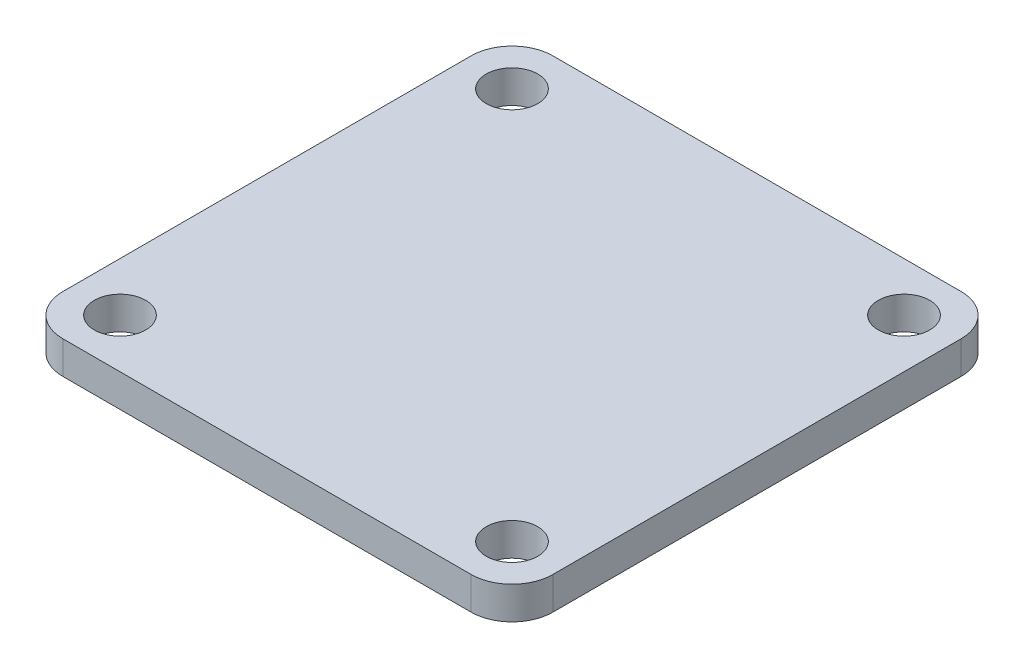
ISO-10303-21;
HEADER;
FILE_DESCRIPTION(('STEP AP214'),'2;1');
FILE_NAME('part.step','',(''),(''),'','','');
FILE_SCHEMA(('AUTOMOTIVE_DESIGN { 1 0 10303 214 1 1 1 1 }'));
ENDSEC;
DATA;
#1=APPLICATION_CONTEXT('core data for automotive mechanical design processes');
#2=APPLICATION_PROTOCOL_DEFINITION('international standard','automotive_design',2000,#1);
#3=PRODUCT_CONTEXT('',#1,'mechanical');
#4=PRODUCT('Part','Part','',(#3));
#5=PRODUCT_RELATED_PRODUCT_CATEGORY('part','',(#4));
#6=PRODUCT_DEFINITION_FORMATION('','',#4);
#7=PRODUCT_DEFINITION_CONTEXT('part definition',#1,'design');
#8=PRODUCT_DEFINITION('design','',#6,#7);
#9=PRODUCT_DEFINITION_SHAPE('','',#8);
#10=(LENGTH_UNIT() NAMED_UNIT(*) SI_UNIT(.MILLI.,.METRE.));
#11=(NAMED_UNIT(*) PLANE_ANGLE_UNIT() SI_UNIT($,.RADIAN.));
#12=(NAMED_UNIT(*) SI_UNIT($,.STERADIAN.) SOLID_ANGLE_UNIT());
#13=UNCERTAINTY_MEASURE_WITH_UNIT(LENGTH_MEASURE(1.E-05),#10,'distance_accuracy_value','');
#14=(GEOMETRIC_REPRESENTATION_CONTEXT(3) GLOBAL_UNCERTAINTY_ASSIGNED_CONTEXT((#13)) GLOBAL_UNIT_ASSIGNED_CONTEXT((#10,
#11,#12)) REPRESENTATION_CONTEXT('',''));
#15=CARTESIAN_POINT('',(0.,0.,0.));
#16=DIRECTION('',(0.,0.,1.));
#17=DIRECTION('',(1.,0.,0.));
#18=AXIS2_PLACEMENT_3D('',#15,#16,#17);
#19=CARTESIAN_POINT('',(0.,4.,0.));
#20=DIRECTION('',(0.,-1.,0.));
#21=DIRECTION('',(0.,0.,-1.));
#22=AXIS2_PLACEMENT_3D('',#19,#20,#21);
#23=PLANE('',#22);
#24=DIRECTION('',(0.,0.,1.));
#25=VECTOR('',#24,1.);
#26=CARTESIAN_POINT('',(-30.,4.,30.));
#27=LINE('',#26,#25);
#28=CARTESIAN_POINT('',(-30.,4.,-25.));
#29=VERTEX_POINT('',#28);
#30=CARTESIAN_POINT('',(-30.,4.,25.));
#31=VERTEX_POINT('',#30);
#32=EDGE_CURVE('E172',#29,#31,#27,.T.);
#33=ORIENTED_EDGE('',*,*,#32,.T.);
#34=CARTESIAN_POINT('',(-25.,4.,25.));
#35=DIRECTION('',(0.,-1.,0.));
#36=DIRECTION('',(0.,0.,-1.));
#37=AXIS2_PLACEMENT_3D('',#34,#35,#36);
#38=CIRCLE('',#37,5.);
#39=CARTESIAN_POINT('',(-25.,4.,30.));
#40=VERTEX_POINT('',#39);
#41=EDGE_CURVE('E149',#31,#40,#38,.F.);
#42=ORIENTED_EDGE('',*,*,#41,.T.);
#43=DIRECTION('',(1.,0.,0.));
#44=VECTOR('',#43,1.);
#45=CARTESIAN_POINT('',(-30.,4.,30.));
#46=LINE('',#45,#44);
#47=CARTESIAN_POINT('',(25.,4.,30.));
#48=VERTEX_POINT('',#47);
#49=EDGE_CURVE('E120',#40,#48,#46,.T.);
#50=ORIENTED_EDGE('',*,*,#49,.T.);
#51=CARTESIAN_POINT('',(25.,4.,25.));
#52=DIRECTION('',(0.,-1.,0.));
#53=DIRECTION('',(0.,0.,-1.));
#54=AXIS2_PLACEMENT_3D('',#51,#52,#53);
#55=CIRCLE('',#54,5.);
#56=CARTESIAN_POINT('',(30.,4.,25.));
#57=VERTEX_POINT('',#56);
#58=EDGE_CURVE('E147',#48,#57,#55,.F.);
#59=ORIENTED_EDGE('',*,*,#58,.T.);
#60=DIRECTION('',(0.,0.,-1.));
#61=VECTOR('',#60,1.);
#62=CARTESIAN_POINT('',(30.,4.,30.));
#63=LINE('',#62,#61);
#64=CARTESIAN_POINT('',(30.,4.,-25.));
#65=VERTEX_POINT('',#64);
#66=EDGE_CURVE('E127',#57,#65,#63,.T.);
#67=ORIENTED_EDGE('',*,*,#66,.T.);
#68=CARTESIAN_POINT('',(25.,4.,-25.));
#69=DIRECTION('',(0.,-1.,0.));
#70=DIRECTION('',(0.,0.,-1.));
#71=AXIS2_PLACEMENT_3D('',#68,#69,#70);
#72=CIRCLE('',#71,5.);
#73=CARTESIAN_POINT('',(25.,4.,-30.));
#74=VERTEX_POINT('',#73);
#75=EDGE_CURVE('E55',#65,#74,#72,.F.);
#76=ORIENTED_EDGE('',*,*,#75,.T.);
#77=DIRECTION('',(-1.,0.,0.));
#78=VECTOR('',#77,1.);
#79=CARTESIAN_POINT('',(-30.,4.,-30.));
#80=LINE('',#79,#78);
#81=CARTESIAN_POINT('',(-25.,4.,-30.));
#82=VERTEX_POINT('',#81);
#83=EDGE_CURVE('E130',#74,#82,#80,.T.);
#84=ORIENTED_EDGE('',*,*,#83,.T.);
#85=CARTESIAN_POINT('',(-25.,4.,-25.));
#86=DIRECTION('',(0.,-1.,0.));
#87=DIRECTION('',(0.,0.,-1.));
#88=AXIS2_PLACEMENT_3D('',#85,#86,#87);
#89=CIRCLE('',#88,5.);
#90=EDGE_CURVE('E144',#82,#29,#89,.F.);
#91=ORIENTED_EDGE('',*,*,#90,.T.);
#92=EDGE_LOOP('',(#33,#42,#50,#59,#67,#76,#84,#91));
#93=FACE_BOUND('',#92,.T.);
#94=CARTESIAN_POINT('',(-24.,4.,-24.));
#95=DIRECTION('',(0.,1.,0.));
#96=DIRECTION('',(0.,0.,1.));
#97=AXIS2_PLACEMENT_3D('',#94,#95,#96);
#98=CIRCLE('',#97,3.15);
#99=CARTESIAN_POINT('',(-24.,4.,-20.85));
#100=VERTEX_POINT('',#99);
#101=EDGE_CURVE('E165',#100,#100,#98,.T.);
#102=ORIENTED_EDGE('',*,*,#101,.F.);
#103=EDGE_LOOP('',(#102));
#104=FACE_BOUND('',#103,.T.);
#105=CARTESIAN_POINT('',(24.,4.,-24.));
#106=DIRECTION('',(0.,1.,0.));
#107=DIRECTION('',(0.,0.,1.));
#108=AXIS2_PLACEMENT_3D('',#105,#106,#107);
#109=CIRCLE('',#108,3.15);
#110=CARTESIAN_POINT('',(24.,4.,-20.85));
#111=VERTEX_POINT('',#110);
#112=EDGE_CURVE('E177',#111,#111,#109,.T.);
#113=ORIENTED_EDGE('',*,*,#112,.F.);
#114=EDGE_LOOP('',(#113));
#115=FACE_BOUND('',#114,.T.);
#116=CARTESIAN_POINT('',(-24.,4.,24.));
#117=DIRECTION('',(0.,1.,0.));
#118=DIRECTION('',(0.,0.,1.));
#119=AXIS2_PLACEMENT_3D('',#116,#117,#118);
#120=CIRCLE('',#119,3.15);
#121=CARTESIAN_POINT('',(-24.,4.,27.15));
#122=VERTEX_POINT('',#121);
#123=EDGE_CURVE('E182',#122,#122,#120,.T.);
#124=ORIENTED_EDGE('',*,*,#123,.F.);
#125=EDGE_LOOP('',(#124));
#126=FACE_BOUND('',#125,.T.);
#127=CARTESIAN_POINT('',(24.,4.,24.));
#128=DIRECTION('',(0.,1.,0.));
#129=DIRECTION('',(0.,0.,1.));
#130=AXIS2_PLACEMENT_3D('',#127,#128,#129);
#131=CIRCLE('',#130,3.15);
#132=CARTESIAN_POINT('',(24.,4.,27.15));
#133=VERTEX_POINT('',#132);
#134=EDGE_CURVE('E188',#133,#133,#131,.T.);
#135=ORIENTED_EDGE('',*,*,#134,.F.);
#136=EDGE_LOOP('',(#135));
#137=FACE_BOUND('',#136,.T.);
#138=ADVANCED_FACE('F34',(#93,#104,#115,#126,#137),#23,.F.);
#139=CARTESIAN_POINT('',(0.,0.,0.));
#140=DIRECTION('',(0.,-1.,0.));
#141=DIRECTION('',(0.,0.,-1.));
#142=AXIS2_PLACEMENT_3D('',#139,#140,#141);
#143=PLANE('',#142);
#144=CARTESIAN_POINT('',(-24.,0.,24.));
#145=DIRECTION('',(0.,1.,0.));
#146=DIRECTION('',(0.,0.,1.));
#147=AXIS2_PLACEMENT_3D('',#144,#145,#146);
#148=CIRCLE('',#147,3.15);
#149=CARTESIAN_POINT('',(-24.,0.,27.15));
#150=VERTEX_POINT('',#149);
#151=EDGE_CURVE('E185',#150,#150,#148,.T.);
#152=ORIENTED_EDGE('',*,*,#151,.T.);
#153=EDGE_LOOP('',(#152));
#154=FACE_BOUND('',#153,.T.);
#155=CARTESIAN_POINT('',(-24.,0.,-24.));
#156=DIRECTION('',(0.,1.,0.));
#157=DIRECTION('',(0.,0.,1.));
#158=AXIS2_PLACEMENT_3D('',#155,#156,#157);
#159=CIRCLE('',#158,3.15);
#160=CARTESIAN_POINT('',(-24.,0.,-20.85));
#161=VERTEX_POINT('',#160);
#162=EDGE_CURVE('E168',#161,#161,#159,.T.);
#163=ORIENTED_EDGE('',*,*,#162,.T.);
#164=EDGE_LOOP('',(#163));
#165=FACE_BOUND('',#164,.T.);
#166=DIRECTION('',(1.,0.,0.));
#167=VECTOR('',#166,1.);
#168=CARTESIAN_POINT('',(-30.,0.,30.));
#169=LINE('',#168,#167);
#170=CARTESIAN_POINT('',(-25.,0.,30.));
#171=VERTEX_POINT('',#170);
#172=CARTESIAN_POINT('',(25.,0.,30.));
#173=VERTEX_POINT('',#172);
#174=EDGE_CURVE('E117',#171,#173,#169,.T.);
#175=ORIENTED_EDGE('',*,*,#174,.F.);
#176=CARTESIAN_POINT('',(-25.,0.,25.));
#177=DIRECTION('',(0.,-1.,0.));
#178=DIRECTION('',(0.,0.,-1.));
#179=AXIS2_PLACEMENT_3D('',#176,#177,#178);
#180=CIRCLE('',#179,5.);
#181=CARTESIAN_POINT('',(-30.,0.,25.));
#182=VERTEX_POINT('',#181);
#183=EDGE_CURVE('E100',#171,#182,#180,.T.);
#184=ORIENTED_EDGE('',*,*,#183,.T.);
#185=DIRECTION('',(0.,0.,1.));
#186=VECTOR('',#185,1.);
#187=CARTESIAN_POINT('',(-30.,0.,30.));
#188=LINE('',#187,#186);
#189=CARTESIAN_POINT('',(-30.,0.,-25.));
#190=VERTEX_POINT('',#189);
#191=EDGE_CURVE('E128',#190,#182,#188,.T.);
#192=ORIENTED_EDGE('',*,*,#191,.F.);
#193=CARTESIAN_POINT('',(-25.,0.,-25.));
#194=DIRECTION('',(0.,-1.,0.));
#195=DIRECTION('',(0.,0.,-1.));
#196=AXIS2_PLACEMENT_3D('',#193,#194,#195);
#197=CIRCLE('',#196,5.);
#198=CARTESIAN_POINT('',(-25.,0.,-30.));
#199=VERTEX_POINT('',#198);
#200=EDGE_CURVE('E121',#190,#199,#197,.T.);
#201=ORIENTED_EDGE('',*,*,#200,.T.);
#202=DIRECTION('',(-1.,0.,0.));
#203=VECTOR('',#202,1.);
#204=CARTESIAN_POINT('',(-30.,0.,-30.));
#205=LINE('',#204,#203);
#206=CARTESIAN_POINT('',(25.,0.,-30.));
#207=VERTEX_POINT('',#206);
#208=EDGE_CURVE('E132',#207,#199,#205,.T.);
#209=ORIENTED_EDGE('',*,*,#208,.F.);
#210=CARTESIAN_POINT('',(25.,0.,-25.));
#211=DIRECTION('',(0.,-1.,0.));
#212=DIRECTION('',(0.,0.,-1.));
#213=AXIS2_PLACEMENT_3D('',#210,#211,#212);
#214=CIRCLE('',#213,5.);
#215=CARTESIAN_POINT('',(30.,0.,-25.));
#216=VERTEX_POINT('',#215);
#217=EDGE_CURVE('E138',#207,#216,#214,.T.);
#218=ORIENTED_EDGE('',*,*,#217,.T.);
#219=DIRECTION('',(0.,0.,-1.));
#220=VECTOR('',#219,1.);
#221=CARTESIAN_POINT('',(30.,0.,30.));
#222=LINE('',#221,#220);
#223=CARTESIAN_POINT('',(30.,0.,25.));
#224=VERTEX_POINT('',#223);
#225=EDGE_CURVE('E160',#224,#216,#222,.T.);
#226=ORIENTED_EDGE('',*,*,#225,.F.);
#227=CARTESIAN_POINT('',(25.,0.,25.));
#228=DIRECTION('',(0.,-1.,0.));
#229=DIRECTION('',(0.,0.,-1.));
#230=AXIS2_PLACEMENT_3D('',#227,#228,#229);
#231=CIRCLE('',#230,5.);
#232=EDGE_CURVE('E111',#224,#173,#231,.T.);
#233=ORIENTED_EDGE('',*,*,#232,.T.);
#234=EDGE_LOOP('',(#175,#184,#192,#201,#209,#218,#226,#233));
#235=FACE_BOUND('',#234,.T.);
#236=CARTESIAN_POINT('',(24.,0.,-24.));
#237=DIRECTION('',(0.,1.,0.));
#238=DIRECTION('',(0.,0.,1.));
#239=AXIS2_PLACEMENT_3D('',#236,#237,#238);
#240=CIRCLE('',#239,3.15);
#241=CARTESIAN_POINT('',(24.,0.,-20.85));
#242=VERTEX_POINT('',#241);
#243=EDGE_CURVE('E179',#242,#242,#240,.T.);
#244=ORIENTED_EDGE('',*,*,#243,.T.);
#245=EDGE_LOOP('',(#244));
#246=FACE_BOUND('',#245,.T.);
#247=CARTESIAN_POINT('',(24.,0.,24.));
#248=DIRECTION('',(0.,1.,0.));
#249=DIRECTION('',(0.,0.,1.));
#250=AXIS2_PLACEMENT_3D('',#247,#248,#249);
#251=CIRCLE('',#250,3.15);
#252=CARTESIAN_POINT('',(24.,0.,27.15));
#253=VERTEX_POINT('',#252);
#254=EDGE_CURVE('E191',#253,#253,#251,.T.);
#255=ORIENTED_EDGE('',*,*,#254,.T.);
#256=EDGE_LOOP('',(#255));
#257=FACE_BOUND('',#256,.T.);
#258=ADVANCED_FACE('F124',(#154,#165,#235,#246,#257),#143,.T.);
#259=CARTESIAN_POINT('',(30.,4.,30.));
#260=DIRECTION('',(-1.,0.,0.));
#261=DIRECTION('',(0.,0.,1.));
#262=AXIS2_PLACEMENT_3D('',#259,#260,#261);
#263=PLANE('',#262);
#264=ORIENTED_EDGE('',*,*,#66,.F.);
#265=DIRECTION('',(0.,-1.,0.));
#266=VECTOR('',#265,1.);
#267=CARTESIAN_POINT('',(30.,4.,25.));
#268=LINE('',#267,#266);
#269=EDGE_CURVE('E153',#57,#224,#268,.T.);
#270=ORIENTED_EDGE('',*,*,#269,.T.);
#271=ORIENTED_EDGE('',*,*,#225,.T.);
#272=DIRECTION('',(0.,-1.,0.));
#273=VECTOR('',#272,1.);
#274=CARTESIAN_POINT('',(30.,4.,-25.));
#275=LINE('',#274,#273);
#276=EDGE_CURVE('E151',#216,#65,#275,.F.);
#277=ORIENTED_EDGE('',*,*,#276,.T.);
#278=EDGE_LOOP('',(#264,#270,#271,#277));
#279=FACE_BOUND('',#278,.T.);
#280=ADVANCED_FACE('F159',(#279),#263,.F.);
#281=CARTESIAN_POINT('',(-30.,4.,-30.));
#282=DIRECTION('',(0.,0.,1.));
#283=DIRECTION('',(1.,0.,0.));
#284=AXIS2_PLACEMENT_3D('',#281,#282,#283);
#285=PLANE('',#284);
#286=ORIENTED_EDGE('',*,*,#83,.F.);
#287=DIRECTION('',(0.,-1.,0.));
#288=VECTOR('',#287,1.);
#289=CARTESIAN_POINT('',(25.,4.,-30.));
#290=LINE('',#289,#288);
#291=EDGE_CURVE('E11',#74,#207,#290,.T.);
#292=ORIENTED_EDGE('',*,*,#291,.T.);
#293=ORIENTED_EDGE('',*,*,#208,.T.);
#294=DIRECTION('',(0.,-1.,0.));
#295=VECTOR('',#294,1.);
#296=CARTESIAN_POINT('',(-25.,4.,-30.));
#297=LINE('',#296,#295);
#298=EDGE_CURVE('E42',#199,#82,#297,.F.);
#299=ORIENTED_EDGE('',*,*,#298,.T.);
#300=EDGE_LOOP('',(#286,#292,#293,#299));
#301=FACE_BOUND('',#300,.T.);
#302=ADVANCED_FACE('F217',(#301),#285,.F.);
#303=CARTESIAN_POINT('',(-30.,4.,30.));
#304=DIRECTION('',(1.,0.,0.));
#305=DIRECTION('',(0.,0.,-1.));
#306=AXIS2_PLACEMENT_3D('',#303,#304,#305);
#307=PLANE('',#306);
#308=ORIENTED_EDGE('',*,*,#191,.T.);
#309=DIRECTION('',(0.,-1.,0.));
#310=VECTOR('',#309,1.);
#311=CARTESIAN_POINT('',(-30.,4.,25.));
#312=LINE('',#311,#310);
#313=EDGE_CURVE('E105',#182,#31,#312,.F.);
#314=ORIENTED_EDGE('',*,*,#313,.T.);
#315=ORIENTED_EDGE('',*,*,#32,.F.);
#316=DIRECTION('',(0.,-1.,0.));
#317=VECTOR('',#316,1.);
#318=CARTESIAN_POINT('',(-30.,4.,-25.));
#319=LINE('',#318,#317);
#320=EDGE_CURVE('E110',#29,#190,#319,.T.);
#321=ORIENTED_EDGE('',*,*,#320,.T.);
#322=EDGE_LOOP('',(#308,#314,#315,#321));
#323=FACE_BOUND('',#322,.T.);
#324=ADVANCED_FACE('F214',(#323),#307,.F.);
#325=CARTESIAN_POINT('',(-30.,4.,30.));
#326=DIRECTION('',(0.,0.,-1.));
#327=DIRECTION('',(-1.,0.,0.));
#328=AXIS2_PLACEMENT_3D('',#325,#326,#327);
#329=PLANE('',#328);
#330=ORIENTED_EDGE('',*,*,#49,.F.);
#331=DIRECTION('',(0.,-1.,0.));
#332=VECTOR('',#331,1.);
#333=CARTESIAN_POINT('',(-25.,4.,30.));
#334=LINE('',#333,#332);
#335=EDGE_CURVE('E104',#40,#171,#334,.T.);
#336=ORIENTED_EDGE('',*,*,#335,.T.);
#337=ORIENTED_EDGE('',*,*,#174,.T.);
#338=DIRECTION('',(0.,-1.,0.));
#339=VECTOR('',#338,1.);
#340=CARTESIAN_POINT('',(25.,4.,30.));
#341=LINE('',#340,#339);
#342=EDGE_CURVE('E122',#173,#48,#341,.F.);
#343=ORIENTED_EDGE('',*,*,#342,.T.);
#344=EDGE_LOOP('',(#330,#336,#337,#343));
#345=FACE_BOUND('',#344,.T.);
#346=ADVANCED_FACE('F116',(#345),#329,.F.);
#347=CARTESIAN_POINT('',(-24.,4.,-24.));
#348=DIRECTION('',(0.,-1.,0.));
#349=DIRECTION('',(0.,0.,-1.));
#350=AXIS2_PLACEMENT_3D('',#347,#348,#349);
#351=CYLINDRICAL_SURFACE('',#350,3.15);
#352=ORIENTED_EDGE('',*,*,#101,.T.);
#353=EDGE_LOOP('',(#352));
#354=FACE_BOUND('',#353,.T.);
#355=ORIENTED_EDGE('',*,*,#162,.F.);
#356=EDGE_LOOP('',(#355));
#357=FACE_BOUND('',#356,.T.);
#358=ADVANCED_FACE('F209',(#354,#357),#351,.F.);
#359=CARTESIAN_POINT('',(24.,4.,-24.));
#360=DIRECTION('',(0.,-1.,0.));
#361=DIRECTION('',(0.,0.,-1.));
#362=AXIS2_PLACEMENT_3D('',#359,#360,#361);
#363=CYLINDRICAL_SURFACE('',#362,3.15);
#364=ORIENTED_EDGE('',*,*,#112,.T.);
#365=EDGE_LOOP('',(#364));
#366=FACE_BOUND('',#365,.T.);
#367=ORIENTED_EDGE('',*,*,#243,.F.);
#368=EDGE_LOOP('',(#367));
#369=FACE_BOUND('',#368,.T.);
#370=ADVANCED_FACE('F310',(#366,#369),#363,.F.);
#371=CARTESIAN_POINT('',(-24.,4.,24.));
#372=DIRECTION('',(0.,-1.,0.));
#373=DIRECTION('',(0.,0.,-1.));
#374=AXIS2_PLACEMENT_3D('',#371,#372,#373);
#375=CYLINDRICAL_SURFACE('',#374,3.15);
#376=ORIENTED_EDGE('',*,*,#123,.T.);
#377=EDGE_LOOP('',(#376));
#378=FACE_BOUND('',#377,.T.);
#379=ORIENTED_EDGE('',*,*,#151,.F.);
#380=EDGE_LOOP('',(#379));
#381=FACE_BOUND('',#380,.T.);
#382=ADVANCED_FACE('F301',(#378,#381),#375,.F.);
#383=CARTESIAN_POINT('',(24.,4.,24.));
#384=DIRECTION('',(0.,-1.,0.));
#385=DIRECTION('',(0.,0.,-1.));
#386=AXIS2_PLACEMENT_3D('',#383,#384,#385);
#387=CYLINDRICAL_SURFACE('',#386,3.15);
#388=ORIENTED_EDGE('',*,*,#134,.T.);
#389=EDGE_LOOP('',(#388));
#390=FACE_BOUND('',#389,.T.);
#391=ORIENTED_EDGE('',*,*,#254,.F.);
#392=EDGE_LOOP('',(#391));
#393=FACE_BOUND('',#392,.T.);
#394=ADVANCED_FACE('F197',(#390,#393),#387,.F.);
#395=CARTESIAN_POINT('',(-25.,4.,25.));
#396=DIRECTION('',(0.,-1.,0.));
#397=DIRECTION('',(0.,0.,-1.));
#398=AXIS2_PLACEMENT_3D('',#395,#396,#397);
#399=CYLINDRICAL_SURFACE('',#398,5.);
#400=ORIENTED_EDGE('',*,*,#41,.F.);
#401=ORIENTED_EDGE('',*,*,#313,.F.);
#402=ORIENTED_EDGE('',*,*,#183,.F.);
#403=ORIENTED_EDGE('',*,*,#335,.F.);
#404=EDGE_LOOP('',(#400,#401,#402,#403));
#405=FACE_BOUND('',#404,.T.);
#406=ADVANCED_FACE('F103',(#405),#399,.T.);
#407=CARTESIAN_POINT('',(25.,4.,25.));
#408=DIRECTION('',(0.,-1.,0.));
#409=DIRECTION('',(0.,0.,-1.));
#410=AXIS2_PLACEMENT_3D('',#407,#408,#409);
#411=CYLINDRICAL_SURFACE('',#410,5.);
#412=ORIENTED_EDGE('',*,*,#58,.F.);
#413=ORIENTED_EDGE('',*,*,#342,.F.);
#414=ORIENTED_EDGE('',*,*,#232,.F.);
#415=ORIENTED_EDGE('',*,*,#269,.F.);
#416=EDGE_LOOP('',(#412,#413,#414,#415));
#417=FACE_BOUND('',#416,.T.);
#418=ADVANCED_FACE('F225',(#417),#411,.T.);
#419=CARTESIAN_POINT('',(25.,4.,-25.));
#420=DIRECTION('',(0.,-1.,0.));
#421=DIRECTION('',(0.,0.,-1.));
#422=AXIS2_PLACEMENT_3D('',#419,#420,#421);
#423=CYLINDRICAL_SURFACE('',#422,5.);
#424=ORIENTED_EDGE('',*,*,#75,.F.);
#425=ORIENTED_EDGE('',*,*,#276,.F.);
#426=ORIENTED_EDGE('',*,*,#217,.F.);
#427=ORIENTED_EDGE('',*,*,#291,.F.);
#428=EDGE_LOOP('',(#424,#425,#426,#427));
#429=FACE_BOUND('',#428,.T.);
#430=ADVANCED_FACE('F227',(#429),#423,.T.);
#431=CARTESIAN_POINT('',(-25.,4.,-25.));
#432=DIRECTION('',(0.,-1.,0.));
#433=DIRECTION('',(0.,0.,-1.));
#434=AXIS2_PLACEMENT_3D('',#431,#432,#433);
#435=CYLINDRICAL_SURFACE('',#434,5.);
#436=ORIENTED_EDGE('',*,*,#90,.F.);
#437=ORIENTED_EDGE('',*,*,#298,.F.);
#438=ORIENTED_EDGE('',*,*,#200,.F.);
#439=ORIENTED_EDGE('',*,*,#320,.F.);
#440=EDGE_LOOP('',(#436,#437,#438,#439));
#441=FACE_BOUND('',#440,.T.);
#442=ADVANCED_FACE('F36',(#441),#435,.T.);
#443=CLOSED_SHELL('',(#138,#258,#280,#302,#324,#346,#358,#370,#382,#394,#406,#418,#430,#442));
#444=MANIFOLD_SOLID_BREP('B2',#443);
#445=ADVANCED_BREP_SHAPE_REPRESENTATION('',(#18,#444),#14);
#446=SHAPE_DEFINITION_REPRESENTATION(#9,#445);
ENDSEC;
END-ISO-10303-21;
